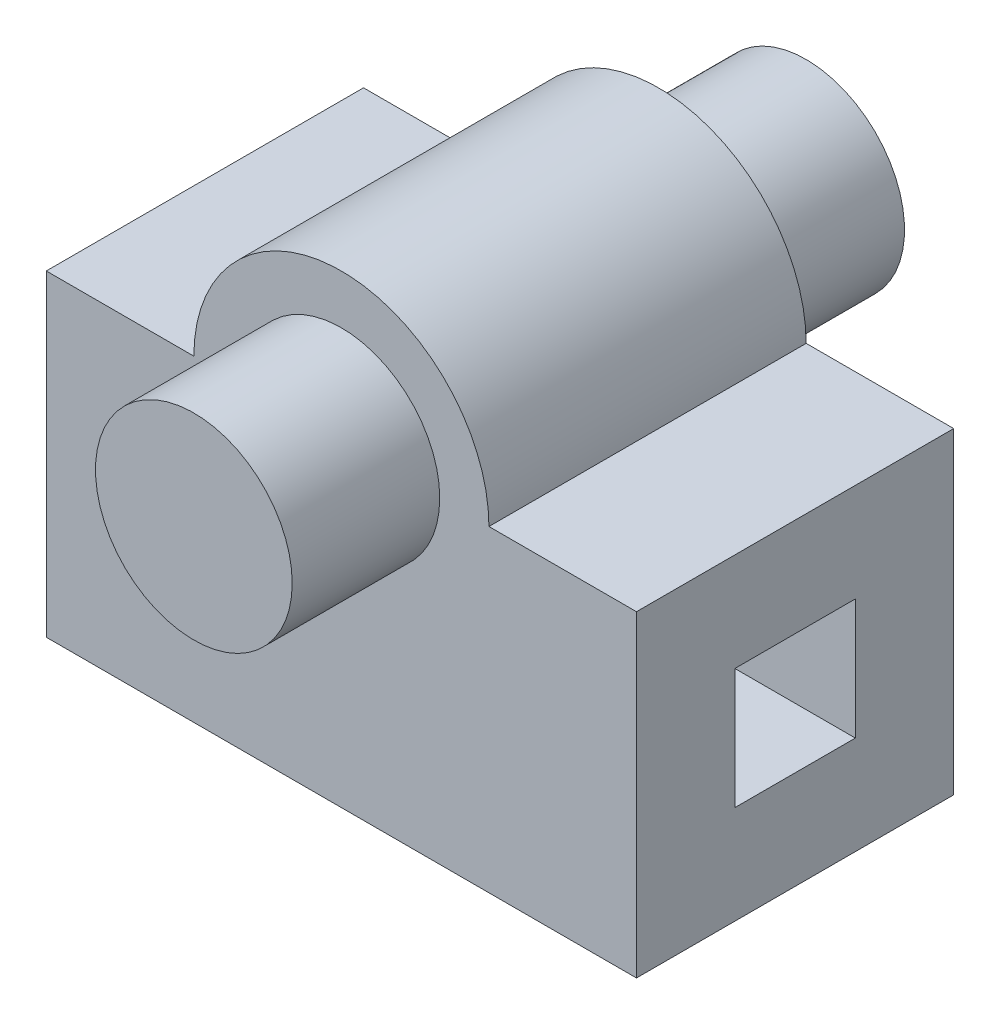
ISO-10303-21;
HEADER;
FILE_DESCRIPTION(('STEP AP214'),'2;1');
FILE_NAME('part.step','',(''),(''),'','','');
FILE_SCHEMA(('AUTOMOTIVE_DESIGN { 1 0 10303 214 1 1 1 1 }'));
ENDSEC;
DATA;
#1=APPLICATION_CONTEXT('core data for automotive mechanical design processes');
#2=APPLICATION_PROTOCOL_DEFINITION('international standard','automotive_design',2000,#1);
#3=PRODUCT_CONTEXT('',#1,'mechanical');
#4=PRODUCT('Part','Part','',(#3));
#5=PRODUCT_RELATED_PRODUCT_CATEGORY('part','',(#4));
#6=PRODUCT_DEFINITION_FORMATION('','',#4);
#7=PRODUCT_DEFINITION_CONTEXT('part definition',#1,'design');
#8=PRODUCT_DEFINITION('design','',#6,#7);
#9=PRODUCT_DEFINITION_SHAPE('','',#8);
#10=(LENGTH_UNIT() NAMED_UNIT(*) SI_UNIT(.MILLI.,.METRE.));
#11=(NAMED_UNIT(*) PLANE_ANGLE_UNIT() SI_UNIT($,.RADIAN.));
#12=(NAMED_UNIT(*) SI_UNIT($,.STERADIAN.) SOLID_ANGLE_UNIT());
#13=UNCERTAINTY_MEASURE_WITH_UNIT(LENGTH_MEASURE(1.E-05),#10,'distance_accuracy_value','');
#14=(GEOMETRIC_REPRESENTATION_CONTEXT(3) GLOBAL_UNCERTAINTY_ASSIGNED_CONTEXT((#13)) GLOBAL_UNIT_ASSIGNED_CONTEXT((#10,
#11,#12)) REPRESENTATION_CONTEXT('',''));
#15=CARTESIAN_POINT('',(0.,0.,0.));
#16=DIRECTION('',(0.,0.,1.));
#17=DIRECTION('',(1.,0.,0.));
#18=AXIS2_PLACEMENT_3D('',#15,#16,#17);
#19=CARTESIAN_POINT('',(0.,44.5,0.));
#20=DIRECTION('',(0.,1.,0.));
#21=DIRECTION('',(0.,0.,1.));
#22=AXIS2_PLACEMENT_3D('',#19,#20,#21);
#23=PLANE('',#22);
#24=DIRECTION('',(0.,0.,1.));
#25=VECTOR('',#24,1.);
#26=CARTESIAN_POINT('',(-30.,44.5,-32.25));
#27=LINE('',#26,#25);
#28=CARTESIAN_POINT('',(-30.,44.5,-32.25));
#29=VERTEX_POINT('',#28);
#30=CARTESIAN_POINT('',(-30.,44.5,32.25));
#31=VERTEX_POINT('',#30);
#32=EDGE_CURVE('E61',#29,#31,#27,.T.);
#33=ORIENTED_EDGE('',*,*,#32,.F.);
#34=DIRECTION('',(-1.,0.,0.));
#35=VECTOR('',#34,1.);
#36=CARTESIAN_POINT('',(-60.,44.5,-32.25));
#37=LINE('',#36,#35);
#38=CARTESIAN_POINT('',(-60.,44.5,-32.25));
#39=VERTEX_POINT('',#38);
#40=EDGE_CURVE('E225',#29,#39,#37,.T.);
#41=ORIENTED_EDGE('',*,*,#40,.T.);
#42=DIRECTION('',(0.,0.,1.));
#43=VECTOR('',#42,1.);
#44=CARTESIAN_POINT('',(-60.,44.5,-32.25));
#45=LINE('',#44,#43);
#46=CARTESIAN_POINT('',(-60.,44.5,32.25));
#47=VERTEX_POINT('',#46);
#48=EDGE_CURVE('E229',#39,#47,#45,.T.);
#49=ORIENTED_EDGE('',*,*,#48,.T.);
#50=DIRECTION('',(1.,0.,0.));
#51=VECTOR('',#50,1.);
#52=CARTESIAN_POINT('',(-60.,44.5,32.25));
#53=LINE('',#52,#51);
#54=EDGE_CURVE('E57',#47,#31,#53,.T.);
#55=ORIENTED_EDGE('',*,*,#54,.T.);
#56=EDGE_LOOP('',(#33,#41,#49,#55));
#57=FACE_BOUND('',#56,.T.);
#58=ADVANCED_FACE('F39',(#57),#23,.T.);
#59=CARTESIAN_POINT('',(60.,44.5,-32.25));
#60=DIRECTION('',(-1.,0.,0.));
#61=DIRECTION('',(0.,0.,1.));
#62=AXIS2_PLACEMENT_3D('',#59,#60,#61);
#63=PLANE('',#62);
#64=DIRECTION('',(0.,0.,1.));
#65=VECTOR('',#64,1.);
#66=CARTESIAN_POINT('',(60.,0.,32.25));
#67=LINE('',#66,#65);
#68=CARTESIAN_POINT('',(60.,0.,-12.25));
#69=VERTEX_POINT('',#68);
#70=CARTESIAN_POINT('',(60.,0.,12.25));
#71=VERTEX_POINT('',#70);
#72=EDGE_CURVE('E147',#69,#71,#67,.T.);
#73=ORIENTED_EDGE('',*,*,#72,.T.);
#74=DIRECTION('',(0.,-1.,0.));
#75=VECTOR('',#74,1.);
#76=CARTESIAN_POINT('',(60.,0.,12.25));
#77=LINE('',#76,#75);
#78=CARTESIAN_POINT('',(60.,24.5,12.25));
#79=VERTEX_POINT('',#78);
#80=EDGE_CURVE('E182',#79,#71,#77,.T.);
#81=ORIENTED_EDGE('',*,*,#80,.F.);
#82=DIRECTION('',(0.,0.,1.));
#83=VECTOR('',#82,1.);
#84=CARTESIAN_POINT('',(60.,24.5,12.25));
#85=LINE('',#84,#83);
#86=CARTESIAN_POINT('',(60.,24.5,-12.25));
#87=VERTEX_POINT('',#86);
#88=EDGE_CURVE('E190',#87,#79,#85,.T.);
#89=ORIENTED_EDGE('',*,*,#88,.F.);
#90=DIRECTION('',(0.,1.,0.));
#91=VECTOR('',#90,1.);
#92=CARTESIAN_POINT('',(60.,0.,-12.25));
#93=LINE('',#92,#91);
#94=EDGE_CURVE('E201',#69,#87,#93,.T.);
#95=ORIENTED_EDGE('',*,*,#94,.F.);
#96=EDGE_LOOP('',(#73,#81,#89,#95));
#97=FACE_BOUND('',#96,.T.);
#98=DIRECTION('',(0.,-1.,0.));
#99=VECTOR('',#98,1.);
#100=CARTESIAN_POINT('',(60.,44.5,32.25));
#101=LINE('',#100,#99);
#102=CARTESIAN_POINT('',(60.,44.5,32.25));
#103=VERTEX_POINT('',#102);
#104=CARTESIAN_POINT('',(60.,-20.,32.25));
#105=VERTEX_POINT('',#104);
#106=EDGE_CURVE('E129',#103,#105,#101,.T.);
#107=ORIENTED_EDGE('',*,*,#106,.T.);
#108=DIRECTION('',(0.,0.,-1.));
#109=VECTOR('',#108,1.);
#110=CARTESIAN_POINT('',(60.,-20.,32.25));
#111=LINE('',#110,#109);
#112=CARTESIAN_POINT('',(60.,-20.,-32.25));
#113=VERTEX_POINT('',#112);
#114=EDGE_CURVE('E137',#105,#113,#111,.T.);
#115=ORIENTED_EDGE('',*,*,#114,.T.);
#116=DIRECTION('',(0.,-1.,0.));
#117=VECTOR('',#116,1.);
#118=CARTESIAN_POINT('',(60.,44.5,-32.25));
#119=LINE('',#118,#117);
#120=CARTESIAN_POINT('',(60.,44.5,-32.25));
#121=VERTEX_POINT('',#120);
#122=EDGE_CURVE('E43',#121,#113,#119,.T.);
#123=ORIENTED_EDGE('',*,*,#122,.F.);
#124=DIRECTION('',(0.,0.,-1.));
#125=VECTOR('',#124,1.);
#126=CARTESIAN_POINT('',(60.,44.5,-32.25));
#127=LINE('',#126,#125);
#128=EDGE_CURVE('E211',#103,#121,#127,.T.);
#129=ORIENTED_EDGE('',*,*,#128,.F.);
#130=EDGE_LOOP('',(#107,#115,#123,#129));
#131=FACE_BOUND('',#130,.T.);
#132=ADVANCED_FACE('F41',(#97,#131),#63,.F.);
#133=CARTESIAN_POINT('',(-60.,44.5,-32.25));
#134=DIRECTION('',(0.,0.,1.));
#135=DIRECTION('',(1.,0.,0.));
#136=AXIS2_PLACEMENT_3D('',#133,#134,#135);
#137=PLANE('',#136);
#138=CARTESIAN_POINT('',(0.,44.5,-32.25));
#139=DIRECTION('',(0.,0.,-1.));
#140=DIRECTION('',(-1.,0.,0.));
#141=AXIS2_PLACEMENT_3D('',#138,#139,#140);
#142=CIRCLE('',#141,20.);
#143=CARTESIAN_POINT('',(-20.,44.5,-32.25));
#144=VERTEX_POINT('',#143);
#145=EDGE_CURVE('E11',#144,#144,#142,.T.);
#146=ORIENTED_EDGE('',*,*,#145,.F.);
#147=EDGE_LOOP('',(#146));
#148=FACE_BOUND('',#147,.T.);
#149=ORIENTED_EDGE('',*,*,#122,.T.);
#150=DIRECTION('',(1.,0.,0.));
#151=VECTOR('',#150,1.);
#152=CARTESIAN_POINT('',(-60.,-20.,-32.25));
#153=LINE('',#152,#151);
#154=CARTESIAN_POINT('',(-60.,-20.,-32.25));
#155=VERTEX_POINT('',#154);
#156=EDGE_CURVE('E139',#155,#113,#153,.T.);
#157=ORIENTED_EDGE('',*,*,#156,.F.);
#158=DIRECTION('',(0.,-1.,0.));
#159=VECTOR('',#158,1.);
#160=CARTESIAN_POINT('',(-60.,44.5,-32.25));
#161=LINE('',#160,#159);
#162=EDGE_CURVE('E128',#39,#155,#161,.T.);
#163=ORIENTED_EDGE('',*,*,#162,.F.);
#164=ORIENTED_EDGE('',*,*,#40,.F.);
#165=CARTESIAN_POINT('',(0.,44.5,-32.25));
#166=DIRECTION('',(0.,0.,1.));
#167=DIRECTION('',(1.,0.,0.));
#168=AXIS2_PLACEMENT_3D('',#165,#166,#167);
#169=CIRCLE('',#168,30.);
#170=CARTESIAN_POINT('',(30.,44.5,-32.25));
#171=VERTEX_POINT('',#170);
#172=EDGE_CURVE('E172',#171,#29,#169,.T.);
#173=ORIENTED_EDGE('',*,*,#172,.F.);
#174=EDGE_CURVE('E226',#121,#171,#37,.T.);
#175=ORIENTED_EDGE('',*,*,#174,.F.);
#176=EDGE_LOOP('',(#149,#157,#163,#164,#173,#175));
#177=FACE_BOUND('',#176,.T.);
#178=ADVANCED_FACE('F240',(#148,#177),#137,.F.);
#179=CARTESIAN_POINT('',(-60.,44.5,-32.25));
#180=DIRECTION('',(1.,0.,0.));
#181=DIRECTION('',(0.,0.,-1.));
#182=AXIS2_PLACEMENT_3D('',#179,#180,#181);
#183=PLANE('',#182);
#184=DIRECTION('',(0.,0.,-1.));
#185=VECTOR('',#184,1.);
#186=CARTESIAN_POINT('',(-60.,-20.,32.25));
#187=LINE('',#186,#185);
#188=CARTESIAN_POINT('',(-60.,-20.,32.25));
#189=VERTEX_POINT('',#188);
#190=EDGE_CURVE('E135',#189,#155,#187,.T.);
#191=ORIENTED_EDGE('',*,*,#190,.F.);
#192=DIRECTION('',(0.,-1.,0.));
#193=VECTOR('',#192,1.);
#194=CARTESIAN_POINT('',(-60.,44.5,32.25));
#195=LINE('',#194,#193);
#196=EDGE_CURVE('E117',#47,#189,#195,.T.);
#197=ORIENTED_EDGE('',*,*,#196,.F.);
#198=ORIENTED_EDGE('',*,*,#48,.F.);
#199=ORIENTED_EDGE('',*,*,#162,.T.);
#200=EDGE_LOOP('',(#191,#197,#198,#199));
#201=FACE_BOUND('',#200,.T.);
#202=DIRECTION('',(0.,0.,1.));
#203=VECTOR('',#202,1.);
#204=CARTESIAN_POINT('',(-60.,24.5,12.25));
#205=LINE('',#204,#203);
#206=CARTESIAN_POINT('',(-60.,24.5,-12.25));
#207=VERTEX_POINT('',#206);
#208=CARTESIAN_POINT('',(-60.,24.5,12.25));
#209=VERTEX_POINT('',#208);
#210=EDGE_CURVE('E194',#207,#209,#205,.T.);
#211=ORIENTED_EDGE('',*,*,#210,.T.);
#212=DIRECTION('',(0.,-1.,0.));
#213=VECTOR('',#212,1.);
#214=CARTESIAN_POINT('',(-60.,0.,12.25));
#215=LINE('',#214,#213);
#216=CARTESIAN_POINT('',(-60.,0.,12.25));
#217=VERTEX_POINT('',#216);
#218=EDGE_CURVE('E185',#209,#217,#215,.T.);
#219=ORIENTED_EDGE('',*,*,#218,.T.);
#220=DIRECTION('',(0.,0.,1.));
#221=VECTOR('',#220,1.);
#222=CARTESIAN_POINT('',(-60.,0.,32.25));
#223=LINE('',#222,#221);
#224=CARTESIAN_POINT('',(-60.,0.,-12.25));
#225=VERTEX_POINT('',#224);
#226=EDGE_CURVE('E140',#225,#217,#223,.T.);
#227=ORIENTED_EDGE('',*,*,#226,.F.);
#228=DIRECTION('',(0.,1.,0.));
#229=VECTOR('',#228,1.);
#230=CARTESIAN_POINT('',(-60.,0.,-12.25));
#231=LINE('',#230,#229);
#232=EDGE_CURVE('E189',#225,#207,#231,.T.);
#233=ORIENTED_EDGE('',*,*,#232,.T.);
#234=EDGE_LOOP('',(#211,#219,#227,#233));
#235=FACE_BOUND('',#234,.T.);
#236=ADVANCED_FACE('F142',(#201,#235),#183,.F.);
#237=CARTESIAN_POINT('',(-60.,44.5,32.25));
#238=DIRECTION('',(0.,0.,-1.));
#239=DIRECTION('',(-1.,0.,0.));
#240=AXIS2_PLACEMENT_3D('',#237,#238,#239);
#241=PLANE('',#240);
#242=CARTESIAN_POINT('',(0.,44.5,32.25));
#243=DIRECTION('',(0.,0.,1.));
#244=DIRECTION('',(1.,0.,0.));
#245=AXIS2_PLACEMENT_3D('',#242,#243,#244);
#246=CIRCLE('',#245,20.);
#247=CARTESIAN_POINT('',(20.,44.5,32.25));
#248=VERTEX_POINT('',#247);
#249=EDGE_CURVE('E49',#248,#248,#246,.T.);
#250=ORIENTED_EDGE('',*,*,#249,.F.);
#251=EDGE_LOOP('',(#250));
#252=FACE_BOUND('',#251,.T.);
#253=ORIENTED_EDGE('',*,*,#196,.T.);
#254=DIRECTION('',(1.,0.,0.));
#255=VECTOR('',#254,1.);
#256=CARTESIAN_POINT('',(-60.,-20.,32.25));
#257=LINE('',#256,#255);
#258=EDGE_CURVE('E121',#189,#105,#257,.T.);
#259=ORIENTED_EDGE('',*,*,#258,.T.);
#260=ORIENTED_EDGE('',*,*,#106,.F.);
#261=CARTESIAN_POINT('',(30.,44.5,32.25));
#262=VERTEX_POINT('',#261);
#263=EDGE_CURVE('E232',#262,#103,#53,.T.);
#264=ORIENTED_EDGE('',*,*,#263,.F.);
#265=CARTESIAN_POINT('',(0.,44.5,32.25));
#266=DIRECTION('',(0.,0.,1.));
#267=DIRECTION('',(1.,0.,0.));
#268=AXIS2_PLACEMENT_3D('',#265,#266,#267);
#269=CIRCLE('',#268,30.);
#270=EDGE_CURVE('E168',#262,#31,#269,.T.);
#271=ORIENTED_EDGE('',*,*,#270,.T.);
#272=ORIENTED_EDGE('',*,*,#54,.F.);
#273=EDGE_LOOP('',(#253,#259,#260,#264,#271,#272));
#274=FACE_BOUND('',#273,.T.);
#275=ADVANCED_FACE('F119',(#252,#274),#241,.F.);
#276=DIRECTION('',(0.,0.,1.));
#277=VECTOR('',#276,1.);
#278=CARTESIAN_POINT('',(30.,44.5,-32.25));
#279=LINE('',#278,#277);
#280=EDGE_CURVE('E178',#171,#262,#279,.T.);
#281=ORIENTED_EDGE('',*,*,#280,.T.);
#282=ORIENTED_EDGE('',*,*,#263,.T.);
#283=ORIENTED_EDGE('',*,*,#128,.T.);
#284=ORIENTED_EDGE('',*,*,#174,.T.);
#285=EDGE_LOOP('',(#281,#282,#283,#284));
#286=FACE_BOUND('',#285,.T.);
#287=ADVANCED_FACE('F248',(#286),#23,.T.);
#288=CARTESIAN_POINT('',(-60.,0.,12.25));
#289=DIRECTION('',(0.,0.,1.));
#290=DIRECTION('',(1.,0.,0.));
#291=AXIS2_PLACEMENT_3D('',#288,#289,#290);
#292=PLANE('',#291);
#293=ORIENTED_EDGE('',*,*,#80,.T.);
#294=DIRECTION('',(1.,0.,0.));
#295=VECTOR('',#294,1.);
#296=CARTESIAN_POINT('',(-60.,0.,12.25));
#297=LINE('',#296,#295);
#298=EDGE_CURVE('E198',#217,#71,#297,.T.);
#299=ORIENTED_EDGE('',*,*,#298,.F.);
#300=ORIENTED_EDGE('',*,*,#218,.F.);
#301=DIRECTION('',(1.,0.,0.));
#302=VECTOR('',#301,1.);
#303=CARTESIAN_POINT('',(-60.,24.5,12.25));
#304=LINE('',#303,#302);
#305=EDGE_CURVE('E208',#209,#79,#304,.T.);
#306=ORIENTED_EDGE('',*,*,#305,.T.);
#307=EDGE_LOOP('',(#293,#299,#300,#306));
#308=FACE_BOUND('',#307,.T.);
#309=ADVANCED_FACE('F261',(#308),#292,.F.);
#310=CARTESIAN_POINT('',(-60.,24.5,12.25));
#311=DIRECTION('',(0.,1.,0.));
#312=DIRECTION('',(0.,0.,1.));
#313=AXIS2_PLACEMENT_3D('',#310,#311,#312);
#314=PLANE('',#313);
#315=ORIENTED_EDGE('',*,*,#88,.T.);
#316=ORIENTED_EDGE('',*,*,#305,.F.);
#317=ORIENTED_EDGE('',*,*,#210,.F.);
#318=DIRECTION('',(1.,0.,0.));
#319=VECTOR('',#318,1.);
#320=CARTESIAN_POINT('',(-60.,24.5,-12.25));
#321=LINE('',#320,#319);
#322=EDGE_CURVE('E212',#207,#87,#321,.T.);
#323=ORIENTED_EDGE('',*,*,#322,.T.);
#324=EDGE_LOOP('',(#315,#316,#317,#323));
#325=FACE_BOUND('',#324,.T.);
#326=ADVANCED_FACE('F266',(#325),#314,.F.);
#327=CARTESIAN_POINT('',(-60.,0.,-12.25));
#328=DIRECTION('',(0.,0.,-1.));
#329=DIRECTION('',(-1.,0.,0.));
#330=AXIS2_PLACEMENT_3D('',#327,#328,#329);
#331=PLANE('',#330);
#332=ORIENTED_EDGE('',*,*,#94,.T.);
#333=ORIENTED_EDGE('',*,*,#322,.F.);
#334=ORIENTED_EDGE('',*,*,#232,.F.);
#335=DIRECTION('',(1.,0.,0.));
#336=VECTOR('',#335,1.);
#337=CARTESIAN_POINT('',(-60.,0.,-12.25));
#338=LINE('',#337,#336);
#339=EDGE_CURVE('E215',#225,#69,#338,.T.);
#340=ORIENTED_EDGE('',*,*,#339,.T.);
#341=EDGE_LOOP('',(#332,#333,#334,#340));
#342=FACE_BOUND('',#341,.T.);
#343=ADVANCED_FACE('F304',(#342),#331,.F.);
#344=CARTESIAN_POINT('',(0.,44.5,-32.25));
#345=DIRECTION('',(0.,0.,1.));
#346=DIRECTION('',(1.,0.,0.));
#347=AXIS2_PLACEMENT_3D('',#344,#345,#346);
#348=CYLINDRICAL_SURFACE('',#347,30.);
#349=ORIENTED_EDGE('',*,*,#270,.F.);
#350=ORIENTED_EDGE('',*,*,#280,.F.);
#351=ORIENTED_EDGE('',*,*,#172,.T.);
#352=ORIENTED_EDGE('',*,*,#32,.T.);
#353=EDGE_LOOP('',(#349,#350,#351,#352));
#354=FACE_BOUND('',#353,.T.);
#355=ADVANCED_FACE('F250',(#354),#348,.T.);
#356=CARTESIAN_POINT('',(0.,44.5,62.25));
#357=DIRECTION('',(0.,0.,-1.));
#358=DIRECTION('',(-1.,0.,0.));
#359=AXIS2_PLACEMENT_3D('',#356,#357,#358);
#360=CYLINDRICAL_SURFACE('',#359,20.);
#361=CARTESIAN_POINT('',(0.,44.5,62.25));
#362=DIRECTION('',(0.,0.,1.));
#363=DIRECTION('',(1.,0.,0.));
#364=AXIS2_PLACEMENT_3D('',#361,#362,#363);
#365=CIRCLE('',#364,20.);
#366=CARTESIAN_POINT('',(20.,44.5,62.25));
#367=VERTEX_POINT('',#366);
#368=EDGE_CURVE('E163',#367,#367,#365,.T.);
#369=ORIENTED_EDGE('',*,*,#368,.F.);
#370=EDGE_LOOP('',(#369));
#371=FACE_BOUND('',#370,.T.);
#372=ORIENTED_EDGE('',*,*,#249,.T.);
#373=EDGE_LOOP('',(#372));
#374=FACE_BOUND('',#373,.T.);
#375=ADVANCED_FACE('F293',(#371,#374),#360,.T.);
#376=CARTESIAN_POINT('',(0.,44.5,62.25));
#377=DIRECTION('',(0.,0.,1.));
#378=DIRECTION('',(1.,0.,0.));
#379=AXIS2_PLACEMENT_3D('',#376,#377,#378);
#380=PLANE('',#379);
#381=ORIENTED_EDGE('',*,*,#368,.T.);
#382=EDGE_LOOP('',(#381));
#383=FACE_BOUND('',#382,.T.);
#384=ADVANCED_FACE('F283',(#383),#380,.T.);
#385=CARTESIAN_POINT('',(0.,44.5,-62.25));
#386=DIRECTION('',(0.,0.,1.));
#387=DIRECTION('',(1.,0.,0.));
#388=AXIS2_PLACEMENT_3D('',#385,#386,#387);
#389=CYLINDRICAL_SURFACE('',#388,20.);
#390=CARTESIAN_POINT('',(0.,44.5,-62.25));
#391=DIRECTION('',(0.,0.,-1.));
#392=DIRECTION('',(-1.,0.,0.));
#393=AXIS2_PLACEMENT_3D('',#390,#391,#392);
#394=CIRCLE('',#393,20.);
#395=CARTESIAN_POINT('',(-20.,44.5,-62.25));
#396=VERTEX_POINT('',#395);
#397=EDGE_CURVE('E159',#396,#396,#394,.T.);
#398=ORIENTED_EDGE('',*,*,#397,.F.);
#399=EDGE_LOOP('',(#398));
#400=FACE_BOUND('',#399,.T.);
#401=ORIENTED_EDGE('',*,*,#145,.T.);
#402=EDGE_LOOP('',(#401));
#403=FACE_BOUND('',#402,.T.);
#404=ADVANCED_FACE('F280',(#400,#403),#389,.T.);
#405=CARTESIAN_POINT('',(0.,44.5,-62.25));
#406=DIRECTION('',(0.,0.,-1.));
#407=DIRECTION('',(-1.,0.,0.));
#408=AXIS2_PLACEMENT_3D('',#405,#406,#407);
#409=PLANE('',#408);
#410=ORIENTED_EDGE('',*,*,#397,.T.);
#411=EDGE_LOOP('',(#410));
#412=FACE_BOUND('',#411,.T.);
#413=ADVANCED_FACE('F282',(#412),#409,.T.);
#414=CARTESIAN_POINT('',(-60.,0.,32.25));
#415=DIRECTION('',(0.,1.,0.));
#416=DIRECTION('',(0.,0.,1.));
#417=AXIS2_PLACEMENT_3D('',#414,#415,#416);
#418=PLANE('',#417);
#419=ORIENTED_EDGE('',*,*,#298,.T.);
#420=ORIENTED_EDGE('',*,*,#72,.F.);
#421=ORIENTED_EDGE('',*,*,#339,.F.);
#422=ORIENTED_EDGE('',*,*,#226,.T.);
#423=EDGE_LOOP('',(#419,#420,#421,#422));
#424=FACE_BOUND('',#423,.T.);
#425=ADVANCED_FACE('F290',(#424),#418,.T.);
#426=CARTESIAN_POINT('',(-60.,-20.,32.25));
#427=DIRECTION('',(0.,-1.,0.));
#428=DIRECTION('',(0.,0.,-1.));
#429=AXIS2_PLACEMENT_3D('',#426,#427,#428);
#430=PLANE('',#429);
#431=ORIENTED_EDGE('',*,*,#114,.F.);
#432=ORIENTED_EDGE('',*,*,#258,.F.);
#433=ORIENTED_EDGE('',*,*,#190,.T.);
#434=ORIENTED_EDGE('',*,*,#156,.T.);
#435=EDGE_LOOP('',(#431,#432,#433,#434));
#436=FACE_BOUND('',#435,.T.);
#437=ADVANCED_FACE('F133',(#436),#430,.T.);
#438=CLOSED_SHELL('',(#58,#132,#178,#236,#275,#287,#309,#326,#343,#355,#375,#384,#404,#413,#425,#437));
#439=MANIFOLD_SOLID_BREP('B2',#438);
#440=ADVANCED_BREP_SHAPE_REPRESENTATION('',(#18,#439),#14);
#441=SHAPE_DEFINITION_REPRESENTATION(#9,#440);
ENDSEC;
END-ISO-10303-21;
